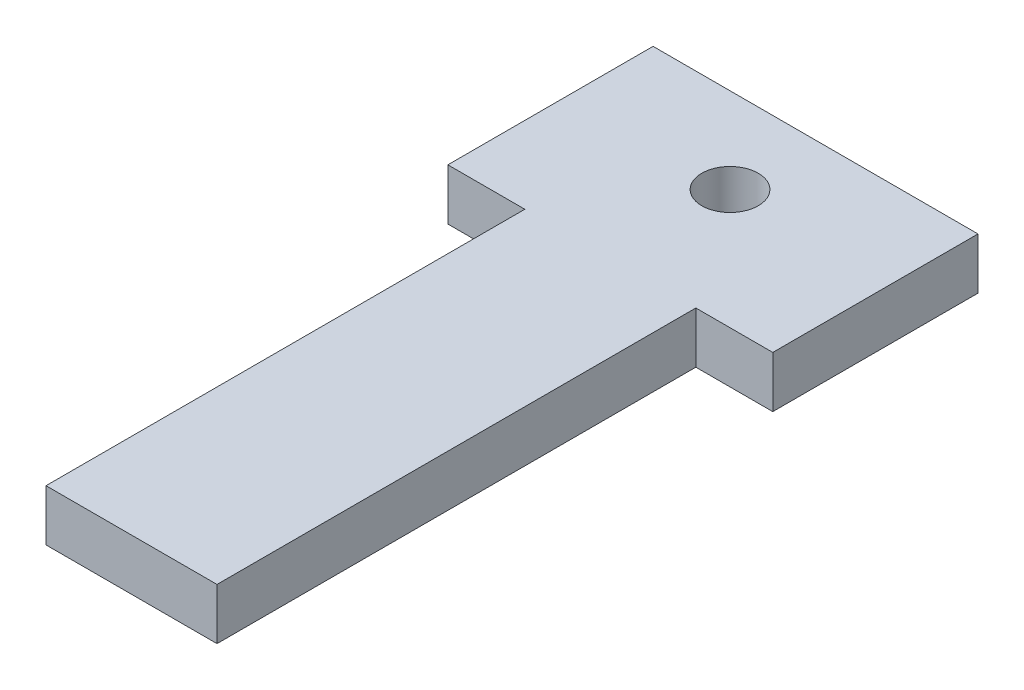
ISO-10303-21;
HEADER;
FILE_DESCRIPTION(('STEP AP214'),'2;1');
FILE_NAME('part.step','',(''),(''),'','','');
FILE_SCHEMA(('AUTOMOTIVE_DESIGN { 1 0 10303 214 1 1 1 1 }'));
ENDSEC;
DATA;
#1=APPLICATION_CONTEXT('core data for automotive mechanical design processes');
#2=APPLICATION_PROTOCOL_DEFINITION('international standard','automotive_design',2000,#1);
#3=PRODUCT_CONTEXT('',#1,'mechanical');
#4=PRODUCT('Part','Part','',(#3));
#5=PRODUCT_RELATED_PRODUCT_CATEGORY('part','',(#4));
#6=PRODUCT_DEFINITION_FORMATION('','',#4);
#7=PRODUCT_DEFINITION_CONTEXT('part definition',#1,'design');
#8=PRODUCT_DEFINITION('design','',#6,#7);
#9=PRODUCT_DEFINITION_SHAPE('','',#8);
#10=(LENGTH_UNIT() NAMED_UNIT(*) SI_UNIT(.MILLI.,.METRE.));
#11=(NAMED_UNIT(*) PLANE_ANGLE_UNIT() SI_UNIT($,.RADIAN.));
#12=(NAMED_UNIT(*) SI_UNIT($,.STERADIAN.) SOLID_ANGLE_UNIT());
#13=UNCERTAINTY_MEASURE_WITH_UNIT(LENGTH_MEASURE(1.E-05),#10,'distance_accuracy_value','');
#14=(GEOMETRIC_REPRESENTATION_CONTEXT(3) GLOBAL_UNCERTAINTY_ASSIGNED_CONTEXT((#13)) GLOBAL_UNIT_ASSIGNED_CONTEXT((#10,
#11,#12)) REPRESENTATION_CONTEXT('',''));
#15=CARTESIAN_POINT('',(0.,0.,0.));
#16=DIRECTION('',(0.,0.,1.));
#17=DIRECTION('',(1.,0.,0.));
#18=AXIS2_PLACEMENT_3D('',#15,#16,#17);
#19=CARTESIAN_POINT('',(0.,3.,-5.));
#20=DIRECTION('',(0.,0.,1.));
#21=DIRECTION('',(1.,0.,0.));
#22=AXIS2_PLACEMENT_3D('',#19,#20,#21);
#23=PLANE('',#22);
#24=DIRECTION('',(-1.,0.,0.));
#25=VECTOR('',#24,1.);
#26=CARTESIAN_POINT('',(0.,0.,-5.));
#27=LINE('',#26,#25);
#28=CARTESIAN_POINT('',(9.50000000000001,0.,-5.));
#29=VERTEX_POINT('',#28);
#30=CARTESIAN_POINT('',(-9.50000000000001,0.,-5.));
#31=VERTEX_POINT('',#30);
#32=EDGE_CURVE('E141',#29,#31,#27,.T.);
#33=ORIENTED_EDGE('',*,*,#32,.T.);
#34=DIRECTION('',(0.,-1.,0.));
#35=VECTOR('',#34,1.);
#36=CARTESIAN_POINT('',(-9.50000000000001,3.,-5.));
#37=LINE('',#36,#35);
#38=CARTESIAN_POINT('',(-9.50000000000001,3.,-5.));
#39=VERTEX_POINT('',#38);
#40=EDGE_CURVE('E11',#39,#31,#37,.T.);
#41=ORIENTED_EDGE('',*,*,#40,.F.);
#42=DIRECTION('',(-1.,0.,0.));
#43=VECTOR('',#42,1.);
#44=CARTESIAN_POINT('',(0.,3.,-5.));
#45=LINE('',#44,#43);
#46=CARTESIAN_POINT('',(9.50000000000001,3.,-5.));
#47=VERTEX_POINT('',#46);
#48=EDGE_CURVE('E96',#47,#39,#45,.T.);
#49=ORIENTED_EDGE('',*,*,#48,.F.);
#50=DIRECTION('',(0.,-1.,0.));
#51=VECTOR('',#50,1.);
#52=CARTESIAN_POINT('',(9.50000000000001,3.,-5.));
#53=LINE('',#52,#51);
#54=EDGE_CURVE('E134',#47,#29,#53,.T.);
#55=ORIENTED_EDGE('',*,*,#54,.T.);
#56=EDGE_LOOP('',(#33,#41,#49,#55));
#57=FACE_BOUND('',#56,.T.);
#58=ADVANCED_FACE('F43',(#57),#23,.F.);
#59=CARTESIAN_POINT('',(-9.50000000000001,3.,0.));
#60=DIRECTION('',(-1.,0.,0.));
#61=DIRECTION('',(0.,0.,1.));
#62=AXIS2_PLACEMENT_3D('',#59,#60,#61);
#63=PLANE('',#62);
#64=DIRECTION('',(0.,0.,-1.));
#65=VECTOR('',#64,1.);
#66=CARTESIAN_POINT('',(-9.50000000000001,0.,0.));
#67=LINE('',#66,#65);
#68=CARTESIAN_POINT('',(-9.5,0.,7.));
#69=VERTEX_POINT('',#68);
#70=EDGE_CURVE('E144',#69,#31,#67,.T.);
#71=ORIENTED_EDGE('',*,*,#70,.F.);
#72=DIRECTION('',(0.,-1.,0.));
#73=VECTOR('',#72,1.);
#74=CARTESIAN_POINT('',(-9.5,3.,7.));
#75=LINE('',#74,#73);
#76=CARTESIAN_POINT('',(-9.5,3.,7.));
#77=VERTEX_POINT('',#76);
#78=EDGE_CURVE('E52',#77,#69,#75,.T.);
#79=ORIENTED_EDGE('',*,*,#78,.F.);
#80=DIRECTION('',(0.,0.,-1.));
#81=VECTOR('',#80,1.);
#82=CARTESIAN_POINT('',(-9.50000000000001,3.,0.));
#83=LINE('',#82,#81);
#84=EDGE_CURVE('E181',#77,#39,#83,.T.);
#85=ORIENTED_EDGE('',*,*,#84,.T.);
#86=ORIENTED_EDGE('',*,*,#40,.T.);
#87=EDGE_LOOP('',(#71,#79,#85,#86));
#88=FACE_BOUND('',#87,.T.);
#89=ADVANCED_FACE('F180',(#88),#63,.T.);
#90=CARTESIAN_POINT('',(0.,3.,7.));
#91=DIRECTION('',(0.,0.,-1.));
#92=DIRECTION('',(-1.,0.,0.));
#93=AXIS2_PLACEMENT_3D('',#90,#91,#92);
#94=PLANE('',#93);
#95=DIRECTION('',(1.,0.,0.));
#96=VECTOR('',#95,1.);
#97=CARTESIAN_POINT('',(0.,0.,7.));
#98=LINE('',#97,#96);
#99=CARTESIAN_POINT('',(-5.00000000000001,0.,7.));
#100=VERTEX_POINT('',#99);
#101=EDGE_CURVE('E147',#69,#100,#98,.T.);
#102=ORIENTED_EDGE('',*,*,#101,.T.);
#103=DIRECTION('',(0.,-1.,0.));
#104=VECTOR('',#103,1.);
#105=CARTESIAN_POINT('',(-5.00000000000001,3.,7.));
#106=LINE('',#105,#104);
#107=CARTESIAN_POINT('',(-5.00000000000001,3.,7.));
#108=VERTEX_POINT('',#107);
#109=EDGE_CURVE('E164',#108,#100,#106,.T.);
#110=ORIENTED_EDGE('',*,*,#109,.F.);
#111=DIRECTION('',(1.,0.,0.));
#112=VECTOR('',#111,1.);
#113=CARTESIAN_POINT('',(0.,3.,7.));
#114=LINE('',#113,#112);
#115=EDGE_CURVE('E171',#77,#108,#114,.T.);
#116=ORIENTED_EDGE('',*,*,#115,.F.);
#117=ORIENTED_EDGE('',*,*,#78,.T.);
#118=EDGE_LOOP('',(#102,#110,#116,#117));
#119=FACE_BOUND('',#118,.T.);
#120=ADVANCED_FACE('F169',(#119),#94,.F.);
#121=CARTESIAN_POINT('',(-5.00000000000001,3.,0.));
#122=DIRECTION('',(1.,0.,0.));
#123=DIRECTION('',(0.,0.,-1.));
#124=AXIS2_PLACEMENT_3D('',#121,#122,#123);
#125=PLANE('',#124);
#126=DIRECTION('',(0.,0.,1.));
#127=VECTOR('',#126,1.);
#128=CARTESIAN_POINT('',(-5.00000000000001,0.,0.));
#129=LINE('',#128,#127);
#130=CARTESIAN_POINT('',(-5.,0.,35.));
#131=VERTEX_POINT('',#130);
#132=EDGE_CURVE('E149',#100,#131,#129,.T.);
#133=ORIENTED_EDGE('',*,*,#132,.T.);
#134=DIRECTION('',(0.,-1.,0.));
#135=VECTOR('',#134,1.);
#136=CARTESIAN_POINT('',(-5.,3.,35.));
#137=LINE('',#136,#135);
#138=CARTESIAN_POINT('',(-5.,3.,35.));
#139=VERTEX_POINT('',#138);
#140=EDGE_CURVE('E161',#139,#131,#137,.T.);
#141=ORIENTED_EDGE('',*,*,#140,.F.);
#142=DIRECTION('',(0.,0.,1.));
#143=VECTOR('',#142,1.);
#144=CARTESIAN_POINT('',(-5.00000000000001,3.,0.));
#145=LINE('',#144,#143);
#146=EDGE_CURVE('E189',#108,#139,#145,.T.);
#147=ORIENTED_EDGE('',*,*,#146,.F.);
#148=ORIENTED_EDGE('',*,*,#109,.T.);
#149=EDGE_LOOP('',(#133,#141,#147,#148));
#150=FACE_BOUND('',#149,.T.);
#151=ADVANCED_FACE('F188',(#150),#125,.F.);
#152=CARTESIAN_POINT('',(0.,3.,35.));
#153=DIRECTION('',(0.,0.,-1.));
#154=DIRECTION('',(-1.,0.,0.));
#155=AXIS2_PLACEMENT_3D('',#152,#153,#154);
#156=PLANE('',#155);
#157=DIRECTION('',(1.,0.,0.));
#158=VECTOR('',#157,1.);
#159=CARTESIAN_POINT('',(0.,0.,35.));
#160=LINE('',#159,#158);
#161=CARTESIAN_POINT('',(5.,0.,35.));
#162=VERTEX_POINT('',#161);
#163=EDGE_CURVE('E151',#131,#162,#160,.T.);
#164=ORIENTED_EDGE('',*,*,#163,.T.);
#165=DIRECTION('',(0.,-1.,0.));
#166=VECTOR('',#165,1.);
#167=CARTESIAN_POINT('',(5.,3.,35.));
#168=LINE('',#167,#166);
#169=CARTESIAN_POINT('',(5.,3.,35.));
#170=VERTEX_POINT('',#169);
#171=EDGE_CURVE('E130',#170,#162,#168,.T.);
#172=ORIENTED_EDGE('',*,*,#171,.F.);
#173=DIRECTION('',(1.,0.,0.));
#174=VECTOR('',#173,1.);
#175=CARTESIAN_POINT('',(0.,3.,35.));
#176=LINE('',#175,#174);
#177=EDGE_CURVE('E117',#139,#170,#176,.T.);
#178=ORIENTED_EDGE('',*,*,#177,.F.);
#179=ORIENTED_EDGE('',*,*,#140,.T.);
#180=EDGE_LOOP('',(#164,#172,#178,#179));
#181=FACE_BOUND('',#180,.T.);
#182=ADVANCED_FACE('F184',(#181),#156,.F.);
#183=CARTESIAN_POINT('',(5.00000000000001,3.,0.));
#184=DIRECTION('',(-1.,0.,0.));
#185=DIRECTION('',(0.,0.,1.));
#186=AXIS2_PLACEMENT_3D('',#183,#184,#185);
#187=PLANE('',#186);
#188=DIRECTION('',(0.,0.,-1.));
#189=VECTOR('',#188,1.);
#190=CARTESIAN_POINT('',(5.00000000000001,0.,0.));
#191=LINE('',#190,#189);
#192=CARTESIAN_POINT('',(5.00000000000001,0.,7.));
#193=VERTEX_POINT('',#192);
#194=EDGE_CURVE('E126',#162,#193,#191,.T.);
#195=ORIENTED_EDGE('',*,*,#194,.T.);
#196=DIRECTION('',(0.,-1.,0.));
#197=VECTOR('',#196,1.);
#198=CARTESIAN_POINT('',(5.00000000000001,3.,7.));
#199=LINE('',#198,#197);
#200=CARTESIAN_POINT('',(5.00000000000001,3.,7.));
#201=VERTEX_POINT('',#200);
#202=EDGE_CURVE('E123',#201,#193,#199,.T.);
#203=ORIENTED_EDGE('',*,*,#202,.F.);
#204=DIRECTION('',(0.,0.,-1.));
#205=VECTOR('',#204,1.);
#206=CARTESIAN_POINT('',(5.00000000000001,3.,0.));
#207=LINE('',#206,#205);
#208=EDGE_CURVE('E111',#170,#201,#207,.T.);
#209=ORIENTED_EDGE('',*,*,#208,.F.);
#210=ORIENTED_EDGE('',*,*,#171,.T.);
#211=EDGE_LOOP('',(#195,#203,#209,#210));
#212=FACE_BOUND('',#211,.T.);
#213=ADVANCED_FACE('F124',(#212),#187,.F.);
#214=CARTESIAN_POINT('',(0.,3.,7.));
#215=DIRECTION('',(0.,0.,1.));
#216=DIRECTION('',(1.,0.,0.));
#217=AXIS2_PLACEMENT_3D('',#214,#215,#216);
#218=PLANE('',#217);
#219=DIRECTION('',(-1.,0.,0.));
#220=VECTOR('',#219,1.);
#221=CARTESIAN_POINT('',(0.,0.,7.));
#222=LINE('',#221,#220);
#223=CARTESIAN_POINT('',(9.5,0.,7.));
#224=VERTEX_POINT('',#223);
#225=EDGE_CURVE('E154',#224,#193,#222,.T.);
#226=ORIENTED_EDGE('',*,*,#225,.F.);
#227=DIRECTION('',(0.,-1.,0.));
#228=VECTOR('',#227,1.);
#229=CARTESIAN_POINT('',(9.5,3.,7.));
#230=LINE('',#229,#228);
#231=CARTESIAN_POINT('',(9.5,3.,7.));
#232=VERTEX_POINT('',#231);
#233=EDGE_CURVE('E87',#232,#224,#230,.T.);
#234=ORIENTED_EDGE('',*,*,#233,.F.);
#235=DIRECTION('',(-1.,0.,0.));
#236=VECTOR('',#235,1.);
#237=CARTESIAN_POINT('',(0.,3.,7.));
#238=LINE('',#237,#236);
#239=EDGE_CURVE('E115',#232,#201,#238,.T.);
#240=ORIENTED_EDGE('',*,*,#239,.T.);
#241=ORIENTED_EDGE('',*,*,#202,.T.);
#242=EDGE_LOOP('',(#226,#234,#240,#241));
#243=FACE_BOUND('',#242,.T.);
#244=ADVANCED_FACE('F132',(#243),#218,.T.);
#245=CARTESIAN_POINT('',(0.,3.,0.));
#246=DIRECTION('',(0.,-1.,0.));
#247=DIRECTION('',(0.,0.,-1.));
#248=AXIS2_PLACEMENT_3D('',#245,#246,#247);
#249=CYLINDRICAL_SURFACE('',#248,1.65);
#250=CARTESIAN_POINT('',(0.,3.,0.));
#251=DIRECTION('',(0.,1.,0.));
#252=DIRECTION('',(0.,0.,1.));
#253=AXIS2_PLACEMENT_3D('',#250,#251,#252);
#254=CIRCLE('',#253,1.65);
#255=CARTESIAN_POINT('',(0.,3.,1.65));
#256=VERTEX_POINT('',#255);
#257=EDGE_CURVE('E157',#256,#256,#254,.T.);
#258=ORIENTED_EDGE('',*,*,#257,.T.);
#259=EDGE_LOOP('',(#258));
#260=FACE_BOUND('',#259,.T.);
#261=CARTESIAN_POINT('',(0.,0.,0.));
#262=DIRECTION('',(0.,1.,0.));
#263=DIRECTION('',(0.,0.,1.));
#264=AXIS2_PLACEMENT_3D('',#261,#262,#263);
#265=CIRCLE('',#264,1.65);
#266=CARTESIAN_POINT('',(0.,0.,1.65));
#267=VERTEX_POINT('',#266);
#268=EDGE_CURVE('E138',#267,#267,#265,.T.);
#269=ORIENTED_EDGE('',*,*,#268,.F.);
#270=EDGE_LOOP('',(#269));
#271=FACE_BOUND('',#270,.T.);
#272=ADVANCED_FACE('F45',(#260,#271),#249,.F.);
#273=CARTESIAN_POINT('',(9.50000000000001,3.,0.));
#274=DIRECTION('',(-1.,0.,0.));
#275=DIRECTION('',(0.,0.,1.));
#276=AXIS2_PLACEMENT_3D('',#273,#274,#275);
#277=PLANE('',#276);
#278=DIRECTION('',(0.,0.,-1.));
#279=VECTOR('',#278,1.);
#280=CARTESIAN_POINT('',(9.50000000000001,0.,0.));
#281=LINE('',#280,#279);
#282=EDGE_CURVE('E90',#224,#29,#281,.T.);
#283=ORIENTED_EDGE('',*,*,#282,.T.);
#284=ORIENTED_EDGE('',*,*,#54,.F.);
#285=DIRECTION('',(0.,0.,-1.));
#286=VECTOR('',#285,1.);
#287=CARTESIAN_POINT('',(9.50000000000001,3.,0.));
#288=LINE('',#287,#286);
#289=EDGE_CURVE('E60',#232,#47,#288,.T.);
#290=ORIENTED_EDGE('',*,*,#289,.F.);
#291=ORIENTED_EDGE('',*,*,#233,.T.);
#292=EDGE_LOOP('',(#283,#284,#290,#291));
#293=FACE_BOUND('',#292,.T.);
#294=ADVANCED_FACE('F201',(#293),#277,.F.);
#295=CARTESIAN_POINT('',(0.,3.,0.));
#296=DIRECTION('',(0.,1.,0.));
#297=DIRECTION('',(0.,0.,1.));
#298=AXIS2_PLACEMENT_3D('',#295,#296,#297);
#299=PLANE('',#298);
#300=ORIENTED_EDGE('',*,*,#257,.F.);
#301=EDGE_LOOP('',(#300));
#302=FACE_BOUND('',#301,.T.);
#303=ORIENTED_EDGE('',*,*,#48,.T.);
#304=ORIENTED_EDGE('',*,*,#84,.F.);
#305=ORIENTED_EDGE('',*,*,#115,.T.);
#306=ORIENTED_EDGE('',*,*,#146,.T.);
#307=ORIENTED_EDGE('',*,*,#177,.T.);
#308=ORIENTED_EDGE('',*,*,#208,.T.);
#309=ORIENTED_EDGE('',*,*,#239,.F.);
#310=ORIENTED_EDGE('',*,*,#289,.T.);
#311=EDGE_LOOP('',(#303,#304,#305,#306,#307,#308,#309,#310));
#312=FACE_BOUND('',#311,.T.);
#313=ADVANCED_FACE('F113',(#302,#312),#299,.T.);
#314=CARTESIAN_POINT('',(0.,0.,0.));
#315=DIRECTION('',(0.,1.,0.));
#316=DIRECTION('',(0.,0.,1.));
#317=AXIS2_PLACEMENT_3D('',#314,#315,#316);
#318=PLANE('',#317);
#319=ORIENTED_EDGE('',*,*,#268,.T.);
#320=EDGE_LOOP('',(#319));
#321=FACE_BOUND('',#320,.T.);
#322=ORIENTED_EDGE('',*,*,#32,.F.);
#323=ORIENTED_EDGE('',*,*,#282,.F.);
#324=ORIENTED_EDGE('',*,*,#225,.T.);
#325=ORIENTED_EDGE('',*,*,#194,.F.);
#326=ORIENTED_EDGE('',*,*,#163,.F.);
#327=ORIENTED_EDGE('',*,*,#132,.F.);
#328=ORIENTED_EDGE('',*,*,#101,.F.);
#329=ORIENTED_EDGE('',*,*,#70,.T.);
#330=EDGE_LOOP('',(#322,#323,#324,#325,#326,#327,#328,#329));
#331=FACE_BOUND('',#330,.T.);
#332=ADVANCED_FACE('F178',(#321,#331),#318,.F.);
#333=CLOSED_SHELL('',(#58,#89,#120,#151,#182,#213,#244,#272,#294,#313,#332));
#334=MANIFOLD_SOLID_BREP('B2',#333);
#335=ADVANCED_BREP_SHAPE_REPRESENTATION('',(#18,#334),#14);
#336=SHAPE_DEFINITION_REPRESENTATION(#9,#335);
ENDSEC;
END-ISO-10303-21;
